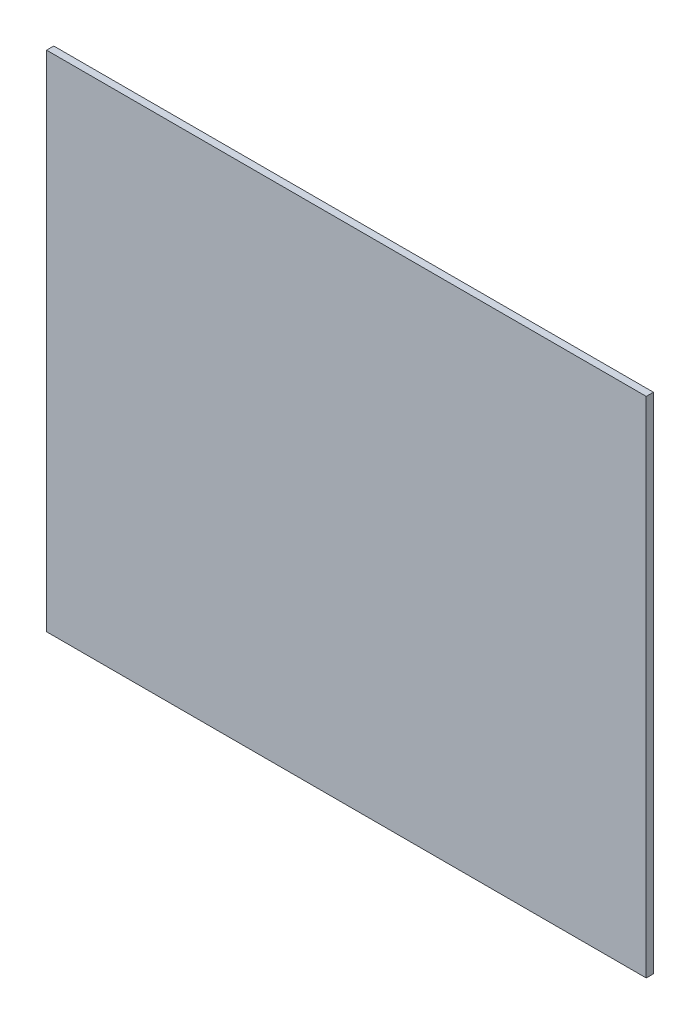
ISO-10303-21;
HEADER;
FILE_DESCRIPTION(('STEP AP214'),'2;1');
FILE_NAME('part.step','',(''),(''),'','','');
FILE_SCHEMA(('AUTOMOTIVE_DESIGN { 1 0 10303 214 1 1 1 1 }'));
ENDSEC;
DATA;
#1=APPLICATION_CONTEXT('core data for automotive mechanical design processes');
#2=APPLICATION_PROTOCOL_DEFINITION('international standard','automotive_design',2000,#1);
#3=PRODUCT_CONTEXT('',#1,'mechanical');
#4=PRODUCT('Part','Part','',(#3));
#5=PRODUCT_RELATED_PRODUCT_CATEGORY('part','',(#4));
#6=PRODUCT_DEFINITION_FORMATION('','',#4);
#7=PRODUCT_DEFINITION_CONTEXT('part definition',#1,'design');
#8=PRODUCT_DEFINITION('design','',#6,#7);
#9=PRODUCT_DEFINITION_SHAPE('','',#8);
#10=(LENGTH_UNIT() NAMED_UNIT(*) SI_UNIT(.MILLI.,.METRE.));
#11=(NAMED_UNIT(*) PLANE_ANGLE_UNIT() SI_UNIT($,.RADIAN.));
#12=(NAMED_UNIT(*) SI_UNIT($,.STERADIAN.) SOLID_ANGLE_UNIT());
#13=UNCERTAINTY_MEASURE_WITH_UNIT(LENGTH_MEASURE(1.E-05),#10,'distance_accuracy_value','');
#14=(GEOMETRIC_REPRESENTATION_CONTEXT(3) GLOBAL_UNCERTAINTY_ASSIGNED_CONTEXT((#13)) GLOBAL_UNIT_ASSIGNED_CONTEXT((#10,
#11,#12)) REPRESENTATION_CONTEXT('',''));
#15=CARTESIAN_POINT('',(0.,0.,0.));
#16=DIRECTION('',(0.,0.,1.));
#17=DIRECTION('',(1.,0.,0.));
#18=AXIS2_PLACEMENT_3D('',#15,#16,#17);
#19=CARTESIAN_POINT('',(0.,0.,-15.));
#20=DIRECTION('',(-1.,0.,0.));
#21=DIRECTION('',(0.,-1.,0.));
#22=AXIS2_PLACEMENT_3D('',#19,#20,#21);
#23=PLANE('',#22);
#24=DIRECTION('',(0.,-1.,0.));
#25=VECTOR('',#24,1.);
#26=CARTESIAN_POINT('',(0.,0.,0.));
#27=LINE('',#26,#25);
#28=CARTESIAN_POINT('',(0.,0.,0.));
#29=VERTEX_POINT('',#28);
#30=CARTESIAN_POINT('',(1.28587913910472E-13,-1050.,0.));
#31=VERTEX_POINT('',#30);
#32=EDGE_CURVE('E102',#29,#31,#27,.T.);
#33=ORIENTED_EDGE('',*,*,#32,.F.);
#34=DIRECTION('',(0.,0.,1.));
#35=VECTOR('',#34,1.);
#36=CARTESIAN_POINT('',(0.,0.,-15.));
#37=LINE('',#36,#35);
#38=CARTESIAN_POINT('',(0.,0.,-15.));
#39=VERTEX_POINT('',#38);
#40=EDGE_CURVE('E11',#39,#29,#37,.T.);
#41=ORIENTED_EDGE('',*,*,#40,.F.);
#42=DIRECTION('',(0.,-1.,0.));
#43=VECTOR('',#42,1.);
#44=CARTESIAN_POINT('',(0.,0.,-15.));
#45=LINE('',#44,#43);
#46=CARTESIAN_POINT('',(1.28587913910472E-13,-1050.,-15.));
#47=VERTEX_POINT('',#46);
#48=EDGE_CURVE('E96',#39,#47,#45,.T.);
#49=ORIENTED_EDGE('',*,*,#48,.T.);
#50=DIRECTION('',(0.,0.,1.));
#51=VECTOR('',#50,1.);
#52=CARTESIAN_POINT('',(1.28587913910472E-13,-1050.,-15.));
#53=LINE('',#52,#51);
#54=EDGE_CURVE('E41',#47,#31,#53,.T.);
#55=ORIENTED_EDGE('',*,*,#54,.T.);
#56=EDGE_LOOP('',(#33,#41,#49,#55));
#57=FACE_BOUND('',#56,.T.);
#58=ADVANCED_FACE('F38',(#57),#23,.T.);
#59=CARTESIAN_POINT('',(0.,0.,-15.));
#60=DIRECTION('',(0.,1.,0.));
#61=DIRECTION('',(0.,0.,1.));
#62=AXIS2_PLACEMENT_3D('',#59,#60,#61);
#63=PLANE('',#62);
#64=DIRECTION('',(-1.,0.,0.));
#65=VECTOR('',#64,1.);
#66=CARTESIAN_POINT('',(0.,0.,0.));
#67=LINE('',#66,#65);
#68=CARTESIAN_POINT('',(1250.,0.,0.));
#69=VERTEX_POINT('',#68);
#70=EDGE_CURVE('E98',#69,#29,#67,.T.);
#71=ORIENTED_EDGE('',*,*,#70,.F.);
#72=DIRECTION('',(0.,0.,1.));
#73=VECTOR('',#72,1.);
#74=CARTESIAN_POINT('',(1250.,0.,-15.));
#75=LINE('',#74,#73);
#76=CARTESIAN_POINT('',(1250.,0.,-15.));
#77=VERTEX_POINT('',#76);
#78=EDGE_CURVE('E47',#77,#69,#75,.T.);
#79=ORIENTED_EDGE('',*,*,#78,.F.);
#80=DIRECTION('',(-1.,0.,0.));
#81=VECTOR('',#80,1.);
#82=CARTESIAN_POINT('',(0.,0.,-15.));
#83=LINE('',#82,#81);
#84=EDGE_CURVE('E93',#77,#39,#83,.T.);
#85=ORIENTED_EDGE('',*,*,#84,.T.);
#86=ORIENTED_EDGE('',*,*,#40,.T.);
#87=EDGE_LOOP('',(#71,#79,#85,#86));
#88=FACE_BOUND('',#87,.T.);
#89=ADVANCED_FACE('F112',(#88),#63,.T.);
#90=CARTESIAN_POINT('',(1250.,0.,-15.));
#91=DIRECTION('',(1.,0.,0.));
#92=DIRECTION('',(0.,1.,0.));
#93=AXIS2_PLACEMENT_3D('',#90,#91,#92);
#94=PLANE('',#93);
#95=DIRECTION('',(0.,1.,0.));
#96=VECTOR('',#95,1.);
#97=CARTESIAN_POINT('',(1250.,0.,0.));
#98=LINE('',#97,#96);
#99=CARTESIAN_POINT('',(1250.,-1050.,0.));
#100=VERTEX_POINT('',#99);
#101=EDGE_CURVE('E88',#100,#69,#98,.T.);
#102=ORIENTED_EDGE('',*,*,#101,.F.);
#103=DIRECTION('',(0.,0.,1.));
#104=VECTOR('',#103,1.);
#105=CARTESIAN_POINT('',(1250.,-1050.,-15.));
#106=LINE('',#105,#104);
#107=CARTESIAN_POINT('',(1250.,-1050.,-15.));
#108=VERTEX_POINT('',#107);
#109=EDGE_CURVE('E83',#108,#100,#106,.T.);
#110=ORIENTED_EDGE('',*,*,#109,.F.);
#111=DIRECTION('',(0.,1.,0.));
#112=VECTOR('',#111,1.);
#113=CARTESIAN_POINT('',(1250.,0.,-15.));
#114=LINE('',#113,#112);
#115=EDGE_CURVE('E86',#108,#77,#114,.T.);
#116=ORIENTED_EDGE('',*,*,#115,.T.);
#117=ORIENTED_EDGE('',*,*,#78,.T.);
#118=EDGE_LOOP('',(#102,#110,#116,#117));
#119=FACE_BOUND('',#118,.T.);
#120=ADVANCED_FACE('F85',(#119),#94,.T.);
#121=CARTESIAN_POINT('',(1.28587913910472E-13,-1050.,-15.));
#122=DIRECTION('',(0.,-1.,0.));
#123=DIRECTION('',(0.,0.,-1.));
#124=AXIS2_PLACEMENT_3D('',#121,#122,#123);
#125=PLANE('',#124);
#126=DIRECTION('',(1.,0.,0.));
#127=VECTOR('',#126,1.);
#128=CARTESIAN_POINT('',(1.28587913910472E-13,-1050.,0.));
#129=LINE('',#128,#127);
#130=EDGE_CURVE('E105',#31,#100,#129,.T.);
#131=ORIENTED_EDGE('',*,*,#130,.F.);
#132=ORIENTED_EDGE('',*,*,#54,.F.);
#133=DIRECTION('',(1.,0.,0.));
#134=VECTOR('',#133,1.);
#135=CARTESIAN_POINT('',(1.28587913910472E-13,-1050.,-15.));
#136=LINE('',#135,#134);
#137=EDGE_CURVE('E92',#47,#108,#136,.T.);
#138=ORIENTED_EDGE('',*,*,#137,.T.);
#139=ORIENTED_EDGE('',*,*,#109,.T.);
#140=EDGE_LOOP('',(#131,#132,#138,#139));
#141=FACE_BOUND('',#140,.T.);
#142=ADVANCED_FACE('F95',(#141),#125,.T.);
#143=CARTESIAN_POINT('',(0.,0.,-15.));
#144=DIRECTION('',(0.,0.,1.));
#145=DIRECTION('',(1.,0.,0.));
#146=AXIS2_PLACEMENT_3D('',#143,#144,#145);
#147=PLANE('',#146);
#148=ORIENTED_EDGE('',*,*,#48,.F.);
#149=ORIENTED_EDGE('',*,*,#84,.F.);
#150=ORIENTED_EDGE('',*,*,#115,.F.);
#151=ORIENTED_EDGE('',*,*,#137,.F.);
#152=EDGE_LOOP('',(#148,#149,#150,#151));
#153=FACE_BOUND('',#152,.T.);
#154=ADVANCED_FACE('F91',(#153),#147,.F.);
#155=CARTESIAN_POINT('',(0.,0.,0.));
#156=DIRECTION('',(0.,0.,1.));
#157=DIRECTION('',(1.,0.,0.));
#158=AXIS2_PLACEMENT_3D('',#155,#156,#157);
#159=PLANE('',#158);
#160=ORIENTED_EDGE('',*,*,#32,.T.);
#161=ORIENTED_EDGE('',*,*,#130,.T.);
#162=ORIENTED_EDGE('',*,*,#101,.T.);
#163=ORIENTED_EDGE('',*,*,#70,.T.);
#164=EDGE_LOOP('',(#160,#161,#162,#163));
#165=FACE_BOUND('',#164,.T.);
#166=ADVANCED_FACE('F111',(#165),#159,.T.);
#167=CLOSED_SHELL('',(#58,#89,#120,#142,#154,#166));
#168=MANIFOLD_SOLID_BREP('B2',#167);
#169=ADVANCED_BREP_SHAPE_REPRESENTATION('',(#18,#168),#14);
#170=SHAPE_DEFINITION_REPRESENTATION(#9,#169);
ENDSEC;
END-ISO-10303-21;
